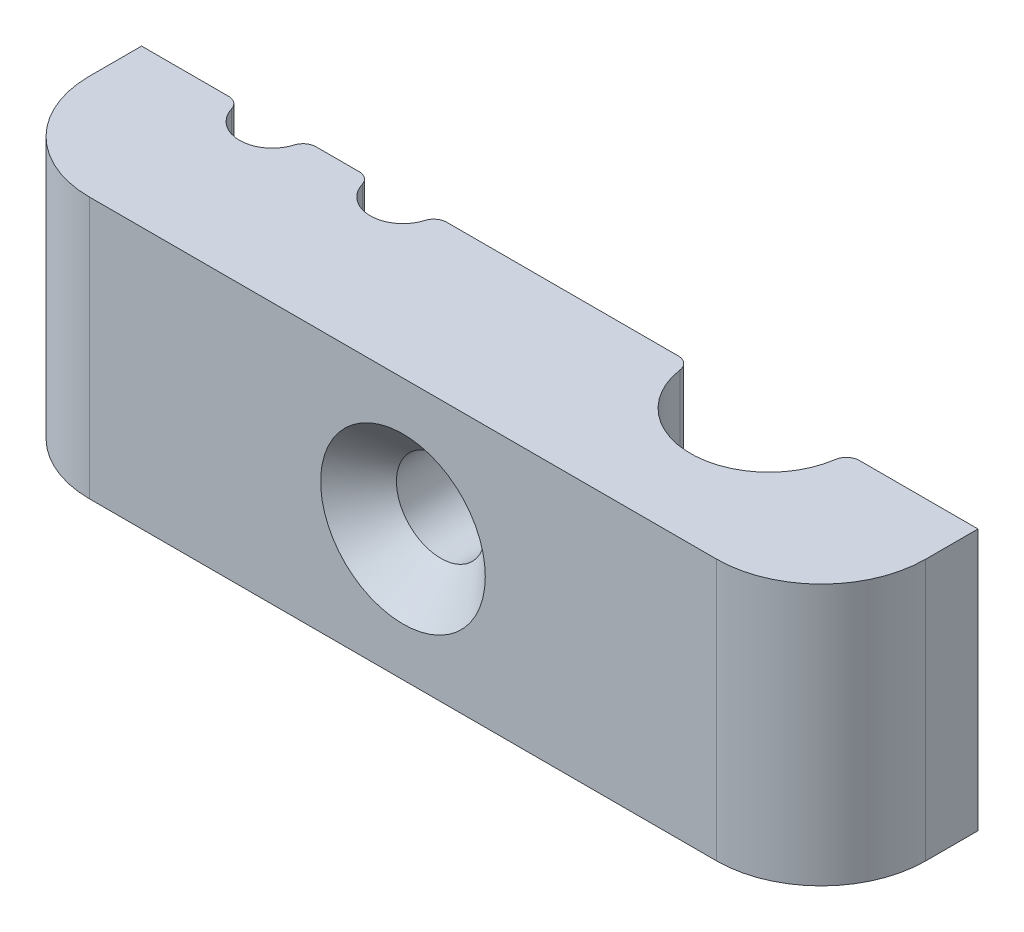
ISO-10303-21;
HEADER;
FILE_DESCRIPTION(('STEP AP214'),'2;1');
FILE_NAME('part.step','',(''),(''),'','','');
FILE_SCHEMA(('AUTOMOTIVE_DESIGN { 1 0 10303 214 1 1 1 1 }'));
ENDSEC;
DATA;
#1=APPLICATION_CONTEXT('core data for automotive mechanical design processes');
#2=APPLICATION_PROTOCOL_DEFINITION('international standard','automotive_design',2000,#1);
#3=PRODUCT_CONTEXT('',#1,'mechanical');
#4=PRODUCT('Part','Part','',(#3));
#5=PRODUCT_RELATED_PRODUCT_CATEGORY('part','',(#4));
#6=PRODUCT_DEFINITION_FORMATION('','',#4);
#7=PRODUCT_DEFINITION_CONTEXT('part definition',#1,'design');
#8=PRODUCT_DEFINITION('design','',#6,#7);
#9=PRODUCT_DEFINITION_SHAPE('','',#8);
#10=(LENGTH_UNIT() NAMED_UNIT(*) SI_UNIT(.MILLI.,.METRE.));
#11=(NAMED_UNIT(*) PLANE_ANGLE_UNIT() SI_UNIT($,.RADIAN.));
#12=(NAMED_UNIT(*) SI_UNIT($,.STERADIAN.) SOLID_ANGLE_UNIT());
#13=UNCERTAINTY_MEASURE_WITH_UNIT(LENGTH_MEASURE(1.E-05),#10,'distance_accuracy_value','');
#14=(GEOMETRIC_REPRESENTATION_CONTEXT(3) GLOBAL_UNCERTAINTY_ASSIGNED_CONTEXT((#13)) GLOBAL_UNIT_ASSIGNED_CONTEXT((#10,
#11,#12)) REPRESENTATION_CONTEXT('',''));
#15=CARTESIAN_POINT('',(0.,0.,0.));
#16=DIRECTION('',(0.,0.,1.));
#17=DIRECTION('',(1.,0.,0.));
#18=AXIS2_PLACEMENT_3D('',#15,#16,#17);
#19=CARTESIAN_POINT('',(0.,0.,0.));
#20=DIRECTION('',(0.,0.,-1.));
#21=DIRECTION('',(-1.,0.,0.));
#22=AXIS2_PLACEMENT_3D('',#19,#20,#21);
#23=PLANE('',#22);
#24=DIRECTION('',(-1.,0.,0.));
#25=VECTOR('',#24,1.);
#26=CARTESIAN_POINT('',(-16.,5.,0.));
#27=LINE('',#26,#25);
#28=CARTESIAN_POINT('',(-12.6770509831248,5.,0.));
#29=VERTEX_POINT('',#28);
#30=CARTESIAN_POINT('',(-16.,5.,0.));
#31=VERTEX_POINT('',#30);
#32=EDGE_CURVE('E197',#29,#31,#27,.T.);
#33=ORIENTED_EDGE('',*,*,#32,.F.);
#34=DIRECTION('',(0.,-1.,0.));
#35=VECTOR('',#34,1.);
#36=CARTESIAN_POINT('',(-12.6770509831248,-5.,0.));
#37=LINE('',#36,#35);
#38=CARTESIAN_POINT('',(-12.6770509831248,-5.,0.));
#39=VERTEX_POINT('',#38);
#40=EDGE_CURVE('E11',#29,#39,#37,.T.);
#41=ORIENTED_EDGE('',*,*,#40,.T.);
#42=DIRECTION('',(1.,0.,0.));
#43=VECTOR('',#42,1.);
#44=CARTESIAN_POINT('',(-16.,-5.,0.));
#45=LINE('',#44,#43);
#46=CARTESIAN_POINT('',(-16.,-5.,0.));
#47=VERTEX_POINT('',#46);
#48=EDGE_CURVE('E213',#47,#39,#45,.T.);
#49=ORIENTED_EDGE('',*,*,#48,.F.);
#50=DIRECTION('',(0.,-1.,0.));
#51=VECTOR('',#50,1.);
#52=CARTESIAN_POINT('',(-16.,-5.,0.));
#53=LINE('',#52,#51);
#54=EDGE_CURVE('E188',#31,#47,#53,.T.);
#55=ORIENTED_EDGE('',*,*,#54,.F.);
#56=EDGE_LOOP('',(#33,#41,#49,#55));
#57=FACE_BOUND('',#56,.T.);
#58=ADVANCED_FACE('F39',(#57),#23,.T.);
#59=CARTESIAN_POINT('',(-7.67705098312484,5.,0.));
#60=VERTEX_POINT('',#59);
#61=CARTESIAN_POINT('',(-9.32294901687515,5.,0.));
#62=VERTEX_POINT('',#61);
#63=EDGE_CURVE('E191',#60,#62,#27,.T.);
#64=ORIENTED_EDGE('',*,*,#63,.F.);
#65=DIRECTION('',(0.,-1.,0.));
#66=VECTOR('',#65,1.);
#67=CARTESIAN_POINT('',(-7.67705098312484,-5.,0.));
#68=LINE('',#67,#66);
#69=CARTESIAN_POINT('',(-7.67705098312484,-5.,0.));
#70=VERTEX_POINT('',#69);
#71=EDGE_CURVE('E311',#60,#70,#68,.T.);
#72=ORIENTED_EDGE('',*,*,#71,.T.);
#73=CARTESIAN_POINT('',(-9.32294901687515,-5.,0.));
#74=VERTEX_POINT('',#73);
#75=EDGE_CURVE('E218',#74,#70,#45,.T.);
#76=ORIENTED_EDGE('',*,*,#75,.F.);
#77=DIRECTION('',(0.,-1.,0.));
#78=VECTOR('',#77,1.);
#79=CARTESIAN_POINT('',(-9.32294901687515,5.,0.));
#80=LINE('',#79,#78);
#81=EDGE_CURVE('E308',#74,#62,#80,.F.);
#82=ORIENTED_EDGE('',*,*,#81,.T.);
#83=EDGE_LOOP('',(#64,#72,#76,#82));
#84=FACE_BOUND('',#83,.T.);
#85=ADVANCED_FACE('F391',(#84),#23,.T.);
#86=CARTESIAN_POINT('',(4.53589838486225,5.,0.));
#87=VERTEX_POINT('',#86);
#88=CARTESIAN_POINT('',(-4.32294901687515,5.,0.));
#89=VERTEX_POINT('',#88);
#90=EDGE_CURVE('E189',#87,#89,#27,.T.);
#91=ORIENTED_EDGE('',*,*,#90,.F.);
#92=DIRECTION('',(0.,-1.,0.));
#93=VECTOR('',#92,1.);
#94=CARTESIAN_POINT('',(4.53589838486225,-5.,0.));
#95=LINE('',#94,#93);
#96=CARTESIAN_POINT('',(4.53589838486225,-5.,0.));
#97=VERTEX_POINT('',#96);
#98=EDGE_CURVE('E298',#87,#97,#95,.T.);
#99=ORIENTED_EDGE('',*,*,#98,.T.);
#100=CARTESIAN_POINT('',(-4.32294901687515,-5.,0.));
#101=VERTEX_POINT('',#100);
#102=EDGE_CURVE('E375',#101,#97,#45,.T.);
#103=ORIENTED_EDGE('',*,*,#102,.F.);
#104=DIRECTION('',(0.,-1.,0.));
#105=VECTOR('',#104,1.);
#106=CARTESIAN_POINT('',(-4.32294901687515,5.,0.));
#107=LINE('',#106,#105);
#108=EDGE_CURVE('E295',#101,#89,#107,.F.);
#109=ORIENTED_EDGE('',*,*,#108,.T.);
#110=EDGE_LOOP('',(#91,#99,#103,#109));
#111=FACE_BOUND('',#110,.T.);
#112=CARTESIAN_POINT('',(0.,0.,0.));
#113=DIRECTION('',(0.,0.,1.));
#114=DIRECTION('',(1.,0.,0.));
#115=AXIS2_PLACEMENT_3D('',#112,#113,#114);
#116=CIRCLE('',#115,1.7);
#117=CARTESIAN_POINT('',(1.7,0.,0.));
#118=VERTEX_POINT('',#117);
#119=EDGE_CURVE('E338',#118,#118,#116,.T.);
#120=ORIENTED_EDGE('',*,*,#119,.T.);
#121=EDGE_LOOP('',(#120));
#122=FACE_BOUND('',#121,.T.);
#123=ADVANCED_FACE('F401',(#111,#122),#23,.T.);
#124=CARTESIAN_POINT('',(16.,-5.,6.));
#125=DIRECTION('',(-1.,0.,0.));
#126=DIRECTION('',(0.,0.,1.));
#127=AXIS2_PLACEMENT_3D('',#124,#125,#126);
#128=PLANE('',#127);
#129=DIRECTION('',(0.,0.,-1.));
#130=VECTOR('',#129,1.);
#131=CARTESIAN_POINT('',(16.,5.,6.));
#132=LINE('',#131,#130);
#133=CARTESIAN_POINT('',(16.,5.,2.));
#134=VERTEX_POINT('',#133);
#135=CARTESIAN_POINT('',(16.,5.,0.));
#136=VERTEX_POINT('',#135);
#137=EDGE_CURVE('E166',#134,#136,#132,.T.);
#138=ORIENTED_EDGE('',*,*,#137,.F.);
#139=DIRECTION('',(0.,1.,0.));
#140=VECTOR('',#139,1.);
#141=CARTESIAN_POINT('',(16.,-5.,2.));
#142=LINE('',#141,#140);
#143=CARTESIAN_POINT('',(16.,-5.,2.));
#144=VERTEX_POINT('',#143);
#145=EDGE_CURVE('E239',#134,#144,#142,.F.);
#146=ORIENTED_EDGE('',*,*,#145,.T.);
#147=DIRECTION('',(0.,0.,-1.));
#148=VECTOR('',#147,1.);
#149=CARTESIAN_POINT('',(16.,-5.,6.));
#150=LINE('',#149,#148);
#151=CARTESIAN_POINT('',(16.,-5.,0.));
#152=VERTEX_POINT('',#151);
#153=EDGE_CURVE('E195',#144,#152,#150,.T.);
#154=ORIENTED_EDGE('',*,*,#153,.T.);
#155=DIRECTION('',(0.,1.,0.));
#156=VECTOR('',#155,1.);
#157=CARTESIAN_POINT('',(16.,-5.,0.));
#158=LINE('',#157,#156);
#159=EDGE_CURVE('E184',#152,#136,#158,.T.);
#160=ORIENTED_EDGE('',*,*,#159,.T.);
#161=EDGE_LOOP('',(#138,#146,#154,#160));
#162=FACE_BOUND('',#161,.T.);
#163=ADVANCED_FACE('F193',(#162),#128,.F.);
#164=CARTESIAN_POINT('',(-16.,5.,6.));
#165=DIRECTION('',(0.,-1.,0.));
#166=DIRECTION('',(0.,0.,-1.));
#167=AXIS2_PLACEMENT_3D('',#164,#165,#166);
#168=PLANE('',#167);
#169=CARTESIAN_POINT('',(11.4641016151378,5.,0.));
#170=VERTEX_POINT('',#169);
#171=EDGE_CURVE('E169',#136,#170,#27,.T.);
#172=ORIENTED_EDGE('',*,*,#171,.T.);
#173=CARTESIAN_POINT('',(11.4641016151378,5.,0.5));
#174=DIRECTION('',(0.,-1.,0.));
#175=DIRECTION('',(0.,0.,-1.));
#176=AXIS2_PLACEMENT_3D('',#173,#174,#175);
#177=CIRCLE('',#176,0.5);
#178=CARTESIAN_POINT('',(10.9692299558324,5.,0.428571428571429));
#179=VERTEX_POINT('',#178);
#180=EDGE_CURVE('E292',#170,#179,#177,.F.);
#181=ORIENTED_EDGE('',*,*,#180,.T.);
#182=CARTESIAN_POINT('',(8.,5.,0.));
#183=DIRECTION('',(0.,1.,0.));
#184=DIRECTION('',(0.,0.,1.));
#185=AXIS2_PLACEMENT_3D('',#182,#183,#184);
#186=CIRCLE('',#185,3.);
#187=CARTESIAN_POINT('',(5.03077004416764,5.,0.428571428571429));
#188=VERTEX_POINT('',#187);
#189=EDGE_CURVE('E354',#188,#179,#186,.T.);
#190=ORIENTED_EDGE('',*,*,#189,.F.);
#191=CARTESIAN_POINT('',(4.53589838486225,5.,0.5));
#192=DIRECTION('',(0.,-1.,0.));
#193=DIRECTION('',(0.,0.,-1.));
#194=AXIS2_PLACEMENT_3D('',#191,#192,#193);
#195=CIRCLE('',#194,0.5);
#196=EDGE_CURVE('E289',#188,#87,#195,.F.);
#197=ORIENTED_EDGE('',*,*,#196,.T.);
#198=ORIENTED_EDGE('',*,*,#90,.T.);
#199=CARTESIAN_POINT('',(-4.32294901687515,5.,0.5));
#200=DIRECTION('',(0.,-1.,0.));
#201=DIRECTION('',(0.,0.,-1.));
#202=AXIS2_PLACEMENT_3D('',#199,#200,#201);
#203=CIRCLE('',#202,0.5);
#204=CARTESIAN_POINT('',(-4.80210644062511,5.,0.357142857142857));
#205=VERTEX_POINT('',#204);
#206=EDGE_CURVE('E55',#89,#205,#203,.F.);
#207=ORIENTED_EDGE('',*,*,#206,.T.);
#208=CARTESIAN_POINT('',(-6.,5.,0.));
#209=DIRECTION('',(0.,1.,0.));
#210=DIRECTION('',(0.,0.,1.));
#211=AXIS2_PLACEMENT_3D('',#208,#209,#210);
#212=CIRCLE('',#211,1.25);
#213=CARTESIAN_POINT('',(-7.19789355937488,5.,0.357142857142857));
#214=VERTEX_POINT('',#213);
#215=EDGE_CURVE('E347',#214,#205,#212,.T.);
#216=ORIENTED_EDGE('',*,*,#215,.F.);
#217=CARTESIAN_POINT('',(-7.67705098312484,5.,0.5));
#218=DIRECTION('',(0.,-1.,0.));
#219=DIRECTION('',(0.,0.,-1.));
#220=AXIS2_PLACEMENT_3D('',#217,#218,#219);
#221=CIRCLE('',#220,0.5);
#222=EDGE_CURVE('E63',#214,#60,#221,.F.);
#223=ORIENTED_EDGE('',*,*,#222,.T.);
#224=ORIENTED_EDGE('',*,*,#63,.T.);
#225=CARTESIAN_POINT('',(-9.32294901687515,5.,0.5));
#226=DIRECTION('',(0.,-1.,0.));
#227=DIRECTION('',(0.,0.,-1.));
#228=AXIS2_PLACEMENT_3D('',#225,#226,#227);
#229=CIRCLE('',#228,0.5);
#230=CARTESIAN_POINT('',(-9.80210644062511,5.,0.357142857142857));
#231=VERTEX_POINT('',#230);
#232=EDGE_CURVE('E282',#62,#231,#229,.F.);
#233=ORIENTED_EDGE('',*,*,#232,.T.);
#234=CARTESIAN_POINT('',(-11.,5.,0.));
#235=DIRECTION('',(0.,1.,0.));
#236=DIRECTION('',(0.,0.,1.));
#237=AXIS2_PLACEMENT_3D('',#234,#235,#236);
#238=CIRCLE('',#237,1.25);
#239=CARTESIAN_POINT('',(-12.1978935593749,5.,0.357142857142857));
#240=VERTEX_POINT('',#239);
#241=EDGE_CURVE('E328',#240,#231,#238,.T.);
#242=ORIENTED_EDGE('',*,*,#241,.F.);
#243=CARTESIAN_POINT('',(-12.6770509831248,5.,0.5));
#244=DIRECTION('',(0.,-1.,0.));
#245=DIRECTION('',(0.,0.,-1.));
#246=AXIS2_PLACEMENT_3D('',#243,#244,#245);
#247=CIRCLE('',#246,0.5);
#248=EDGE_CURVE('E279',#240,#29,#247,.F.);
#249=ORIENTED_EDGE('',*,*,#248,.T.);
#250=ORIENTED_EDGE('',*,*,#32,.T.);
#251=DIRECTION('',(0.,0.,-1.));
#252=VECTOR('',#251,1.);
#253=CARTESIAN_POINT('',(-16.,5.,6.));
#254=LINE('',#253,#252);
#255=CARTESIAN_POINT('',(-16.,5.,2.));
#256=VERTEX_POINT('',#255);
#257=EDGE_CURVE('E178',#256,#31,#254,.T.);
#258=ORIENTED_EDGE('',*,*,#257,.F.);
#259=CARTESIAN_POINT('',(-12.,5.,2.));
#260=DIRECTION('',(0.,-1.,0.));
#261=DIRECTION('',(0.,0.,-1.));
#262=AXIS2_PLACEMENT_3D('',#259,#260,#261);
#263=CIRCLE('',#262,4.);
#264=CARTESIAN_POINT('',(-12.,5.,6.));
#265=VERTEX_POINT('',#264);
#266=EDGE_CURVE('E234',#256,#265,#263,.F.);
#267=ORIENTED_EDGE('',*,*,#266,.T.);
#268=DIRECTION('',(-1.,0.,0.));
#269=VECTOR('',#268,1.);
#270=CARTESIAN_POINT('',(-16.,5.,6.));
#271=LINE('',#270,#269);
#272=CARTESIAN_POINT('',(12.,5.,6.));
#273=VERTEX_POINT('',#272);
#274=EDGE_CURVE('E217',#273,#265,#271,.T.);
#275=ORIENTED_EDGE('',*,*,#274,.F.);
#276=CARTESIAN_POINT('',(12.,5.,2.));
#277=DIRECTION('',(0.,-1.,0.));
#278=DIRECTION('',(0.,0.,-1.));
#279=AXIS2_PLACEMENT_3D('',#276,#277,#278);
#280=CIRCLE('',#279,4.);
#281=EDGE_CURVE('E172',#273,#134,#280,.F.);
#282=ORIENTED_EDGE('',*,*,#281,.T.);
#283=ORIENTED_EDGE('',*,*,#137,.T.);
#284=EDGE_LOOP('',(#172,#181,#190,#197,#198,#207,#216,#223,#224,#233,#242,#249,#250,#258,#267,
#275,#282,#283));
#285=FACE_BOUND('',#284,.T.);
#286=ADVANCED_FACE('F168',(#285),#168,.F.);
#287=CARTESIAN_POINT('',(-16.,-5.,6.));
#288=DIRECTION('',(1.,0.,0.));
#289=DIRECTION('',(0.,0.,-1.));
#290=AXIS2_PLACEMENT_3D('',#287,#288,#289);
#291=PLANE('',#290);
#292=DIRECTION('',(0.,0.,-1.));
#293=VECTOR('',#292,1.);
#294=CARTESIAN_POINT('',(-16.,-5.,6.));
#295=LINE('',#294,#293);
#296=CARTESIAN_POINT('',(-16.,-5.,2.));
#297=VERTEX_POINT('',#296);
#298=EDGE_CURVE('E221',#297,#47,#295,.T.);
#299=ORIENTED_EDGE('',*,*,#298,.F.);
#300=DIRECTION('',(0.,-1.,0.));
#301=VECTOR('',#300,1.);
#302=CARTESIAN_POINT('',(-16.,-5.,2.));
#303=LINE('',#302,#301);
#304=EDGE_CURVE('E248',#297,#256,#303,.F.);
#305=ORIENTED_EDGE('',*,*,#304,.T.);
#306=ORIENTED_EDGE('',*,*,#257,.T.);
#307=ORIENTED_EDGE('',*,*,#54,.T.);
#308=EDGE_LOOP('',(#299,#305,#306,#307));
#309=FACE_BOUND('',#308,.T.);
#310=ADVANCED_FACE('F446',(#309),#291,.F.);
#311=CARTESIAN_POINT('',(-16.,-5.,6.));
#312=DIRECTION('',(0.,1.,0.));
#313=DIRECTION('',(0.,0.,1.));
#314=AXIS2_PLACEMENT_3D('',#311,#312,#313);
#315=PLANE('',#314);
#316=CARTESIAN_POINT('',(8.,-5.,0.));
#317=DIRECTION('',(0.,1.,0.));
#318=DIRECTION('',(0.,0.,1.));
#319=AXIS2_PLACEMENT_3D('',#316,#317,#318);
#320=CIRCLE('',#319,3.);
#321=CARTESIAN_POINT('',(5.03077004416764,-5.,0.428571428571429));
#322=VERTEX_POINT('',#321);
#323=CARTESIAN_POINT('',(10.9692299558324,-5.,0.428571428571429));
#324=VERTEX_POINT('',#323);
#325=EDGE_CURVE('E350',#322,#324,#320,.T.);
#326=ORIENTED_EDGE('',*,*,#325,.T.);
#327=CARTESIAN_POINT('',(11.4641016151378,-5.,0.5));
#328=DIRECTION('',(0.,1.,0.));
#329=DIRECTION('',(0.,0.,1.));
#330=AXIS2_PLACEMENT_3D('',#327,#328,#329);
#331=CIRCLE('',#330,0.5);
#332=CARTESIAN_POINT('',(11.4641016151378,-5.,0.));
#333=VERTEX_POINT('',#332);
#334=EDGE_CURVE('E274',#324,#333,#331,.F.);
#335=ORIENTED_EDGE('',*,*,#334,.T.);
#336=EDGE_CURVE('E212',#333,#152,#45,.T.);
#337=ORIENTED_EDGE('',*,*,#336,.T.);
#338=ORIENTED_EDGE('',*,*,#153,.F.);
#339=CARTESIAN_POINT('',(12.,-5.,2.));
#340=DIRECTION('',(0.,1.,0.));
#341=DIRECTION('',(0.,0.,1.));
#342=AXIS2_PLACEMENT_3D('',#339,#340,#341);
#343=CIRCLE('',#342,4.);
#344=CARTESIAN_POINT('',(12.,-5.,6.));
#345=VERTEX_POINT('',#344);
#346=EDGE_CURVE('E245',#144,#345,#343,.F.);
#347=ORIENTED_EDGE('',*,*,#346,.T.);
#348=DIRECTION('',(1.,0.,0.));
#349=VECTOR('',#348,1.);
#350=CARTESIAN_POINT('',(-16.,-5.,6.));
#351=LINE('',#350,#349);
#352=CARTESIAN_POINT('',(-12.,-5.,6.));
#353=VERTEX_POINT('',#352);
#354=EDGE_CURVE('E206',#353,#345,#351,.T.);
#355=ORIENTED_EDGE('',*,*,#354,.F.);
#356=CARTESIAN_POINT('',(-12.,-5.,2.));
#357=DIRECTION('',(0.,1.,0.));
#358=DIRECTION('',(0.,0.,1.));
#359=AXIS2_PLACEMENT_3D('',#356,#357,#358);
#360=CIRCLE('',#359,4.);
#361=EDGE_CURVE('E242',#353,#297,#360,.F.);
#362=ORIENTED_EDGE('',*,*,#361,.T.);
#363=ORIENTED_EDGE('',*,*,#298,.T.);
#364=ORIENTED_EDGE('',*,*,#48,.T.);
#365=CARTESIAN_POINT('',(-12.6770509831248,-5.,0.5));
#366=DIRECTION('',(0.,1.,0.));
#367=DIRECTION('',(0.,0.,1.));
#368=AXIS2_PLACEMENT_3D('',#365,#366,#367);
#369=CIRCLE('',#368,0.5);
#370=CARTESIAN_POINT('',(-12.1978935593749,-5.,0.357142857142857));
#371=VERTEX_POINT('',#370);
#372=EDGE_CURVE('E259',#39,#371,#369,.F.);
#373=ORIENTED_EDGE('',*,*,#372,.T.);
#374=CARTESIAN_POINT('',(-11.,-5.,0.));
#375=DIRECTION('',(0.,1.,0.));
#376=DIRECTION('',(0.,0.,1.));
#377=AXIS2_PLACEMENT_3D('',#374,#375,#376);
#378=CIRCLE('',#377,1.25);
#379=CARTESIAN_POINT('',(-9.80210644062511,-5.,0.357142857142857));
#380=VERTEX_POINT('',#379);
#381=EDGE_CURVE('E325',#371,#380,#378,.T.);
#382=ORIENTED_EDGE('',*,*,#381,.T.);
#383=CARTESIAN_POINT('',(-9.32294901687515,-5.,0.5));
#384=DIRECTION('',(0.,1.,0.));
#385=DIRECTION('',(0.,0.,1.));
#386=AXIS2_PLACEMENT_3D('',#383,#384,#385);
#387=CIRCLE('',#386,0.5);
#388=EDGE_CURVE('E262',#380,#74,#387,.F.);
#389=ORIENTED_EDGE('',*,*,#388,.T.);
#390=ORIENTED_EDGE('',*,*,#75,.T.);
#391=CARTESIAN_POINT('',(-7.67705098312484,-5.,0.5));
#392=DIRECTION('',(0.,1.,0.));
#393=DIRECTION('',(0.,0.,1.));
#394=AXIS2_PLACEMENT_3D('',#391,#392,#393);
#395=CIRCLE('',#394,0.5);
#396=CARTESIAN_POINT('',(-7.19789355937488,-5.,0.357142857142857));
#397=VERTEX_POINT('',#396);
#398=EDGE_CURVE('E265',#70,#397,#395,.F.);
#399=ORIENTED_EDGE('',*,*,#398,.T.);
#400=CARTESIAN_POINT('',(-6.,-5.,0.));
#401=DIRECTION('',(0.,1.,0.));
#402=DIRECTION('',(0.,0.,1.));
#403=AXIS2_PLACEMENT_3D('',#400,#401,#402);
#404=CIRCLE('',#403,1.25);
#405=CARTESIAN_POINT('',(-4.80210644062511,-5.,0.357142857142857));
#406=VERTEX_POINT('',#405);
#407=EDGE_CURVE('E344',#397,#406,#404,.T.);
#408=ORIENTED_EDGE('',*,*,#407,.T.);
#409=CARTESIAN_POINT('',(-4.32294901687515,-5.,0.5));
#410=DIRECTION('',(0.,1.,0.));
#411=DIRECTION('',(0.,0.,1.));
#412=AXIS2_PLACEMENT_3D('',#409,#410,#411);
#413=CIRCLE('',#412,0.5);
#414=EDGE_CURVE('E268',#406,#101,#413,.F.);
#415=ORIENTED_EDGE('',*,*,#414,.T.);
#416=ORIENTED_EDGE('',*,*,#102,.T.);
#417=CARTESIAN_POINT('',(4.53589838486225,-5.,0.5));
#418=DIRECTION('',(0.,1.,0.));
#419=DIRECTION('',(0.,0.,1.));
#420=AXIS2_PLACEMENT_3D('',#417,#418,#419);
#421=CIRCLE('',#420,0.5);
#422=EDGE_CURVE('E271',#97,#322,#421,.F.);
#423=ORIENTED_EDGE('',*,*,#422,.T.);
#424=EDGE_LOOP('',(#326,#335,#337,#338,#347,#355,#362,#363,#364,#373,#382,#389,#390,#399,#408,
#415,#416,#423));
#425=FACE_BOUND('',#424,.T.);
#426=ADVANCED_FACE('F333',(#425),#315,.F.);
#427=CARTESIAN_POINT('',(0.,0.,6.));
#428=DIRECTION('',(0.,0.,-1.));
#429=DIRECTION('',(-1.,0.,0.));
#430=AXIS2_PLACEMENT_3D('',#427,#428,#429);
#431=PLANE('',#430);
#432=CARTESIAN_POINT('',(0.,0.,6.));
#433=DIRECTION('',(0.,0.,1.));
#434=DIRECTION('',(1.,0.,0.));
#435=AXIS2_PLACEMENT_3D('',#432,#433,#434);
#436=CIRCLE('',#435,3.15);
#437=CARTESIAN_POINT('',(3.15,0.,6.));
#438=VERTEX_POINT('',#437);
#439=EDGE_CURVE('E198',#438,#438,#436,.T.);
#440=ORIENTED_EDGE('',*,*,#439,.F.);
#441=EDGE_LOOP('',(#440));
#442=FACE_BOUND('',#441,.T.);
#443=ORIENTED_EDGE('',*,*,#354,.T.);
#444=DIRECTION('',(0.,1.,0.));
#445=VECTOR('',#444,1.);
#446=CARTESIAN_POINT('',(12.,0.,6.));
#447=LINE('',#446,#445);
#448=EDGE_CURVE('E230',#345,#273,#447,.T.);
#449=ORIENTED_EDGE('',*,*,#448,.T.);
#450=ORIENTED_EDGE('',*,*,#274,.T.);
#451=DIRECTION('',(0.,-1.,0.));
#452=VECTOR('',#451,1.);
#453=CARTESIAN_POINT('',(-12.,0.,6.));
#454=LINE('',#453,#452);
#455=EDGE_CURVE('E177',#265,#353,#454,.T.);
#456=ORIENTED_EDGE('',*,*,#455,.T.);
#457=EDGE_LOOP('',(#443,#449,#450,#456));
#458=FACE_BOUND('',#457,.T.);
#459=ADVANCED_FACE('F370',(#442,#458),#431,.F.);
#460=ORIENTED_EDGE('',*,*,#336,.F.);
#461=DIRECTION('',(0.,-1.,0.));
#462=VECTOR('',#461,1.);
#463=CARTESIAN_POINT('',(11.4641016151378,5.,0.));
#464=LINE('',#463,#462);
#465=EDGE_CURVE('E186',#333,#170,#464,.F.);
#466=ORIENTED_EDGE('',*,*,#465,.T.);
#467=ORIENTED_EDGE('',*,*,#171,.F.);
#468=ORIENTED_EDGE('',*,*,#159,.F.);
#469=EDGE_LOOP('',(#460,#466,#467,#468));
#470=FACE_BOUND('',#469,.T.);
#471=ADVANCED_FACE('F183',(#470),#23,.T.);
#472=CARTESIAN_POINT('',(12.,0.,2.));
#473=DIRECTION('',(0.,1.,0.));
#474=DIRECTION('',(0.,0.,1.));
#475=AXIS2_PLACEMENT_3D('',#472,#473,#474);
#476=CYLINDRICAL_SURFACE('',#475,4.);
#477=ORIENTED_EDGE('',*,*,#346,.F.);
#478=ORIENTED_EDGE('',*,*,#145,.F.);
#479=ORIENTED_EDGE('',*,*,#281,.F.);
#480=ORIENTED_EDGE('',*,*,#448,.F.);
#481=EDGE_LOOP('',(#477,#478,#479,#480));
#482=FACE_BOUND('',#481,.T.);
#483=ADVANCED_FACE('F373',(#482),#476,.T.);
#484=CARTESIAN_POINT('',(-12.,0.,2.));
#485=DIRECTION('',(0.,-1.,0.));
#486=DIRECTION('',(0.,0.,-1.));
#487=AXIS2_PLACEMENT_3D('',#484,#485,#486);
#488=CYLINDRICAL_SURFACE('',#487,4.);
#489=ORIENTED_EDGE('',*,*,#266,.F.);
#490=ORIENTED_EDGE('',*,*,#304,.F.);
#491=ORIENTED_EDGE('',*,*,#361,.F.);
#492=ORIENTED_EDGE('',*,*,#455,.F.);
#493=EDGE_LOOP('',(#489,#490,#491,#492));
#494=FACE_BOUND('',#493,.T.);
#495=ADVANCED_FACE('F435',(#494),#488,.T.);
#496=CARTESIAN_POINT('',(0.,0.,12.35));
#497=DIRECTION('',(0.,0.,1.));
#498=DIRECTION('',(1.,0.,0.));
#499=AXIS2_PLACEMENT_3D('',#496,#497,#498);
#500=CYLINDRICAL_SURFACE('',#499,1.7);
#501=CARTESIAN_POINT('',(0.,0.,4.55));
#502=DIRECTION('',(0.,0.,1.));
#503=DIRECTION('',(1.,0.,0.));
#504=AXIS2_PLACEMENT_3D('',#501,#502,#503);
#505=CIRCLE('',#504,1.7);
#506=CARTESIAN_POINT('',(1.7,0.,4.55));
#507=VERTEX_POINT('',#506);
#508=EDGE_CURVE('E203',#507,#507,#505,.T.);
#509=ORIENTED_EDGE('',*,*,#508,.T.);
#510=EDGE_LOOP('',(#509));
#511=FACE_BOUND('',#510,.T.);
#512=ORIENTED_EDGE('',*,*,#119,.F.);
#513=EDGE_LOOP('',(#512));
#514=FACE_BOUND('',#513,.T.);
#515=ADVANCED_FACE('F450',(#511,#514),#500,.F.);
#516=CARTESIAN_POINT('',(0.,0.,4.55));
#517=DIRECTION('',(0.,0.,1.));
#518=DIRECTION('',(1.,0.,0.));
#519=AXIS2_PLACEMENT_3D('',#516,#517,#518);
#520=CONICAL_SURFACE('',#519,1.7,0.785398163397448);
#521=ORIENTED_EDGE('',*,*,#439,.T.);
#522=EDGE_LOOP('',(#521));
#523=FACE_BOUND('',#522,.T.);
#524=ORIENTED_EDGE('',*,*,#508,.F.);
#525=EDGE_LOOP('',(#524));
#526=FACE_BOUND('',#525,.T.);
#527=ADVANCED_FACE('F455',(#523,#526),#520,.F.);
#528=CARTESIAN_POINT('',(8.,-5.,0.));
#529=DIRECTION('',(0.,1.,0.));
#530=DIRECTION('',(0.,0.,1.));
#531=AXIS2_PLACEMENT_3D('',#528,#529,#530);
#532=CYLINDRICAL_SURFACE('',#531,3.);
#533=ORIENTED_EDGE('',*,*,#189,.T.);
#534=DIRECTION('',(0.,1.,0.));
#535=VECTOR('',#534,1.);
#536=CARTESIAN_POINT('',(10.9692299558324,-5.,0.428571428571429));
#537=LINE('',#536,#535);
#538=EDGE_CURVE('E255',#179,#324,#537,.F.);
#539=ORIENTED_EDGE('',*,*,#538,.T.);
#540=ORIENTED_EDGE('',*,*,#325,.F.);
#541=DIRECTION('',(0.,1.,0.));
#542=VECTOR('',#541,1.);
#543=CARTESIAN_POINT('',(5.03077004416764,-5.,0.428571428571429));
#544=LINE('',#543,#542);
#545=EDGE_CURVE('E251',#322,#188,#544,.T.);
#546=ORIENTED_EDGE('',*,*,#545,.T.);
#547=EDGE_LOOP('',(#533,#539,#540,#546));
#548=FACE_BOUND('',#547,.T.);
#549=ADVANCED_FACE('F408',(#548),#532,.F.);
#550=CARTESIAN_POINT('',(-6.,-5.,0.));
#551=DIRECTION('',(0.,1.,0.));
#552=DIRECTION('',(0.,0.,1.));
#553=AXIS2_PLACEMENT_3D('',#550,#551,#552);
#554=CYLINDRICAL_SURFACE('',#553,1.25);
#555=ORIENTED_EDGE('',*,*,#215,.T.);
#556=DIRECTION('',(0.,1.,0.));
#557=VECTOR('',#556,1.);
#558=CARTESIAN_POINT('',(-4.80210644062511,-5.,0.357142857142857));
#559=LINE('',#558,#557);
#560=EDGE_CURVE('E304',#205,#406,#559,.F.);
#561=ORIENTED_EDGE('',*,*,#560,.T.);
#562=ORIENTED_EDGE('',*,*,#407,.F.);
#563=DIRECTION('',(0.,1.,0.));
#564=VECTOR('',#563,1.);
#565=CARTESIAN_POINT('',(-7.19789355937488,-5.,0.357142857142857));
#566=LINE('',#565,#564);
#567=EDGE_CURVE('E301',#397,#214,#566,.T.);
#568=ORIENTED_EDGE('',*,*,#567,.T.);
#569=EDGE_LOOP('',(#555,#561,#562,#568));
#570=FACE_BOUND('',#569,.T.);
#571=ADVANCED_FACE('F387',(#570),#554,.F.);
#572=CARTESIAN_POINT('',(-11.,-5.,0.));
#573=DIRECTION('',(0.,1.,0.));
#574=DIRECTION('',(0.,0.,1.));
#575=AXIS2_PLACEMENT_3D('',#572,#573,#574);
#576=CYLINDRICAL_SURFACE('',#575,1.25);
#577=ORIENTED_EDGE('',*,*,#241,.T.);
#578=DIRECTION('',(0.,1.,0.));
#579=VECTOR('',#578,1.);
#580=CARTESIAN_POINT('',(-9.80210644062511,-5.,0.357142857142857));
#581=LINE('',#580,#579);
#582=EDGE_CURVE('E48',#231,#380,#581,.F.);
#583=ORIENTED_EDGE('',*,*,#582,.T.);
#584=ORIENTED_EDGE('',*,*,#381,.F.);
#585=DIRECTION('',(0.,1.,0.));
#586=VECTOR('',#585,1.);
#587=CARTESIAN_POINT('',(-12.1978935593749,-5.,0.357142857142857));
#588=LINE('',#587,#586);
#589=EDGE_CURVE('E314',#371,#240,#588,.T.);
#590=ORIENTED_EDGE('',*,*,#589,.T.);
#591=EDGE_LOOP('',(#577,#583,#584,#590));
#592=FACE_BOUND('',#591,.T.);
#593=ADVANCED_FACE('F324',(#592),#576,.F.);
#594=CARTESIAN_POINT('',(11.4641016151378,-5.,0.5));
#595=DIRECTION('',(0.,1.,0.));
#596=DIRECTION('',(0.,0.,1.));
#597=AXIS2_PLACEMENT_3D('',#594,#595,#596);
#598=CYLINDRICAL_SURFACE('',#597,0.5);
#599=ORIENTED_EDGE('',*,*,#180,.F.);
#600=ORIENTED_EDGE('',*,*,#465,.F.);
#601=ORIENTED_EDGE('',*,*,#334,.F.);
#602=ORIENTED_EDGE('',*,*,#538,.F.);
#603=EDGE_LOOP('',(#599,#600,#601,#602));
#604=FACE_BOUND('',#603,.T.);
#605=ADVANCED_FACE('F411',(#604),#598,.T.);
#606=CARTESIAN_POINT('',(4.53589838486225,-5.,0.5));
#607=DIRECTION('',(0.,1.,0.));
#608=DIRECTION('',(0.,0.,1.));
#609=AXIS2_PLACEMENT_3D('',#606,#607,#608);
#610=CYLINDRICAL_SURFACE('',#609,0.5);
#611=ORIENTED_EDGE('',*,*,#422,.F.);
#612=ORIENTED_EDGE('',*,*,#98,.F.);
#613=ORIENTED_EDGE('',*,*,#196,.F.);
#614=ORIENTED_EDGE('',*,*,#545,.F.);
#615=EDGE_LOOP('',(#611,#612,#613,#614));
#616=FACE_BOUND('',#615,.T.);
#617=ADVANCED_FACE('F404',(#616),#610,.T.);
#618=CARTESIAN_POINT('',(-4.32294901687515,-5.,0.5));
#619=DIRECTION('',(0.,1.,0.));
#620=DIRECTION('',(0.,0.,1.));
#621=AXIS2_PLACEMENT_3D('',#618,#619,#620);
#622=CYLINDRICAL_SURFACE('',#621,0.5);
#623=ORIENTED_EDGE('',*,*,#206,.F.);
#624=ORIENTED_EDGE('',*,*,#108,.F.);
#625=ORIENTED_EDGE('',*,*,#414,.F.);
#626=ORIENTED_EDGE('',*,*,#560,.F.);
#627=EDGE_LOOP('',(#623,#624,#625,#626));
#628=FACE_BOUND('',#627,.T.);
#629=ADVANCED_FACE('F400',(#628),#622,.T.);
#630=CARTESIAN_POINT('',(-7.67705098312484,-5.,0.5));
#631=DIRECTION('',(0.,1.,0.));
#632=DIRECTION('',(0.,0.,1.));
#633=AXIS2_PLACEMENT_3D('',#630,#631,#632);
#634=CYLINDRICAL_SURFACE('',#633,0.5);
#635=ORIENTED_EDGE('',*,*,#398,.F.);
#636=ORIENTED_EDGE('',*,*,#71,.F.);
#637=ORIENTED_EDGE('',*,*,#222,.F.);
#638=ORIENTED_EDGE('',*,*,#567,.F.);
#639=EDGE_LOOP('',(#635,#636,#637,#638));
#640=FACE_BOUND('',#639,.T.);
#641=ADVANCED_FACE('F385',(#640),#634,.T.);
#642=CARTESIAN_POINT('',(-9.32294901687515,-5.,0.5));
#643=DIRECTION('',(0.,1.,0.));
#644=DIRECTION('',(0.,0.,1.));
#645=AXIS2_PLACEMENT_3D('',#642,#643,#644);
#646=CYLINDRICAL_SURFACE('',#645,0.5);
#647=ORIENTED_EDGE('',*,*,#232,.F.);
#648=ORIENTED_EDGE('',*,*,#81,.F.);
#649=ORIENTED_EDGE('',*,*,#388,.F.);
#650=ORIENTED_EDGE('',*,*,#582,.F.);
#651=EDGE_LOOP('',(#647,#648,#649,#650));
#652=FACE_BOUND('',#651,.T.);
#653=ADVANCED_FACE('F467',(#652),#646,.T.);
#654=CARTESIAN_POINT('',(-12.6770509831248,-5.,0.5));
#655=DIRECTION('',(0.,1.,0.));
#656=DIRECTION('',(0.,0.,1.));
#657=AXIS2_PLACEMENT_3D('',#654,#655,#656);
#658=CYLINDRICAL_SURFACE('',#657,0.5);
#659=ORIENTED_EDGE('',*,*,#372,.F.);
#660=ORIENTED_EDGE('',*,*,#40,.F.);
#661=ORIENTED_EDGE('',*,*,#248,.F.);
#662=ORIENTED_EDGE('',*,*,#589,.F.);
#663=EDGE_LOOP('',(#659,#660,#661,#662));
#664=FACE_BOUND('',#663,.T.);
#665=ADVANCED_FACE('F41',(#664),#658,.T.);
#666=CLOSED_SHELL('',(#58,#85,#123,#163,#286,#310,#426,#459,#471,#483,#495,#515,#527,#549,#571,
#593,#605,#617,#629,#641,#653,#665));
#667=MANIFOLD_SOLID_BREP('B2',#666);
#668=ADVANCED_BREP_SHAPE_REPRESENTATION('',(#18,#667),#14);
#669=SHAPE_DEFINITION_REPRESENTATION(#9,#668);
ENDSEC;
END-ISO-10303-21;
